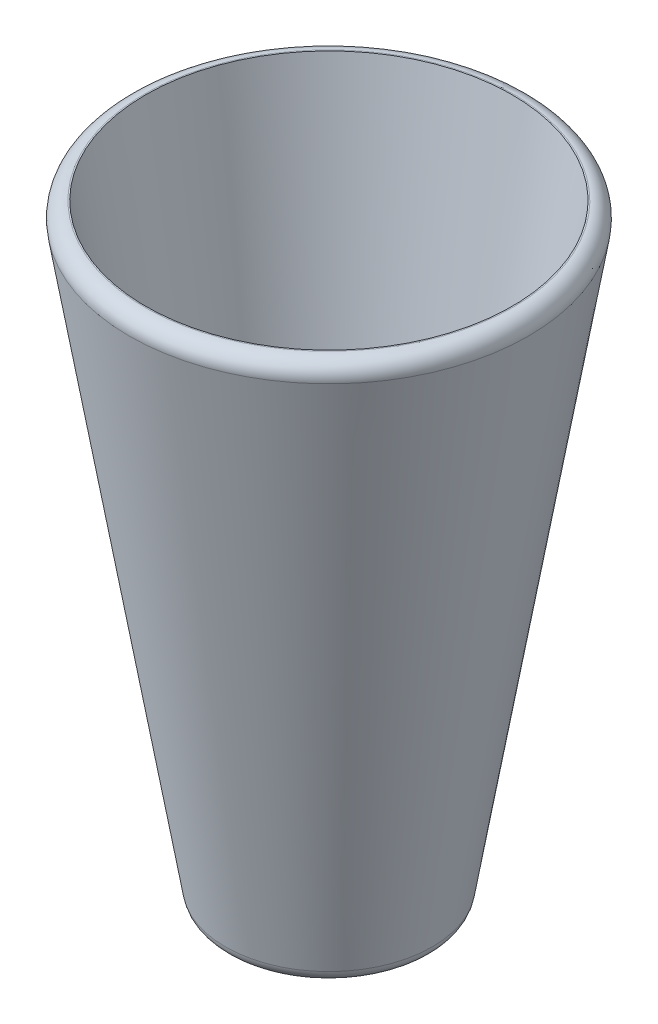
ISO-10303-21;
HEADER;
FILE_DESCRIPTION(('STEP AP214'),'2;1');
FILE_NAME('part.step','',(''),(''),'','','');
FILE_SCHEMA(('AUTOMOTIVE_DESIGN { 1 0 10303 214 1 1 1 1 }'));
ENDSEC;
DATA;
#1=APPLICATION_CONTEXT('core data for automotive mechanical design processes');
#2=APPLICATION_PROTOCOL_DEFINITION('international standard','automotive_design',2000,#1);
#3=PRODUCT_CONTEXT('',#1,'mechanical');
#4=PRODUCT('Part','Part','',(#3));
#5=PRODUCT_RELATED_PRODUCT_CATEGORY('part','',(#4));
#6=PRODUCT_DEFINITION_FORMATION('','',#4);
#7=PRODUCT_DEFINITION_CONTEXT('part definition',#1,'design');
#8=PRODUCT_DEFINITION('design','',#6,#7);
#9=PRODUCT_DEFINITION_SHAPE('','',#8);
#10=(LENGTH_UNIT() NAMED_UNIT(*) SI_UNIT(.MILLI.,.METRE.));
#11=(NAMED_UNIT(*) PLANE_ANGLE_UNIT() SI_UNIT($,.RADIAN.));
#12=(NAMED_UNIT(*) SI_UNIT($,.STERADIAN.) SOLID_ANGLE_UNIT());
#13=UNCERTAINTY_MEASURE_WITH_UNIT(LENGTH_MEASURE(1.E-05),#10,'distance_accuracy_value','');
#14=(GEOMETRIC_REPRESENTATION_CONTEXT(3) GLOBAL_UNCERTAINTY_ASSIGNED_CONTEXT((#13)) GLOBAL_UNIT_ASSIGNED_CONTEXT((#10,
#11,#12)) REPRESENTATION_CONTEXT('',''));
#15=CARTESIAN_POINT('',(0.,0.,0.));
#16=DIRECTION('',(0.,0.,1.));
#17=DIRECTION('',(1.,0.,0.));
#18=AXIS2_PLACEMENT_3D('',#15,#16,#17);
#19=CARTESIAN_POINT('',(1.46986121258818E-13,-380.841690925662,0.));
#20=DIRECTION('',(0.,1.,0.));
#21=DIRECTION('',(-1.,0.,0.));
#22=AXIS2_PLACEMENT_3D('',#19,#20,#21);
#23=PLANE('',#22);
#24=CARTESIAN_POINT('',(1.46986121258818E-13,-380.841690925662,0.));
#25=DIRECTION('',(0.,1.,0.));
#26=DIRECTION('',(-1.,0.,0.));
#27=AXIS2_PLACEMENT_3D('',#24,#25,#26);
#28=CIRCLE('',#27,174.586187348509);
#29=CARTESIAN_POINT('',(-174.586187348509,-380.841690925662,0.));
#30=VERTEX_POINT('',#29);
#31=EDGE_CURVE('E45',#30,#30,#28,.F.);
#32=ORIENTED_EDGE('',*,*,#31,.T.);
#33=EDGE_LOOP('',(#32));
#34=FACE_BOUND('',#33,.T.);
#35=ADVANCED_FACE('F37',(#34),#23,.F.);
#36=CARTESIAN_POINT('',(1.43319829761952E-13,-350.590646864208,0.));
#37=DIRECTION('',(0.,-1.,0.));
#38=DIRECTION('',(1.,0.,0.));
#39=AXIS2_PLACEMENT_3D('',#36,#37,#38);
#40=PLANE('',#39);
#41=CARTESIAN_POINT('',(1.43319829761952E-13,-350.590646864208,0.));
#42=DIRECTION('',(0.,1.,0.));
#43=DIRECTION('',(-1.,0.,0.));
#44=AXIS2_PLACEMENT_3D('',#41,#42,#43);
#45=CIRCLE('',#44,167.107446813264);
#46=CARTESIAN_POINT('',(-167.107446813263,-350.590646864208,0.));
#47=VERTEX_POINT('',#46);
#48=EDGE_CURVE('E61',#47,#47,#45,.T.);
#49=ORIENTED_EDGE('',*,*,#48,.T.);
#50=EDGE_LOOP('',(#49));
#51=FACE_BOUND('',#50,.T.);
#52=ADVANCED_FACE('F83',(#51),#40,.F.);
#53=CARTESIAN_POINT('',(0.,819.158309074338,0.));
#54=DIRECTION('',(0.,1.,0.));
#55=DIRECTION('',(-1.,0.,0.));
#56=AXIS2_PLACEMENT_3D('',#53,#54,#55);
#57=CONICAL_SURFACE('',#56,362.065606136355,0.165148677414627);
#58=ORIENTED_EDGE('',*,*,#48,.F.);
#59=EDGE_LOOP('',(#58));
#60=FACE_BOUND('',#59,.T.);
#61=CARTESIAN_POINT('',(0.,819.158309074338,0.));
#62=DIRECTION('',(0.,1.,0.));
#63=DIRECTION('',(-1.,0.,0.));
#64=AXIS2_PLACEMENT_3D('',#61,#62,#63);
#65=CIRCLE('',#64,362.065606136355);
#66=CARTESIAN_POINT('',(-362.065606136355,819.158309074338,0.));
#67=VERTEX_POINT('',#66);
#68=EDGE_CURVE('E65',#67,#67,#65,.T.);
#69=ORIENTED_EDGE('',*,*,#68,.T.);
#70=EDGE_LOOP('',(#69));
#71=FACE_BOUND('',#70,.T.);
#72=ADVANCED_FACE('F70',(#60,#71),#57,.F.);
#73=CARTESIAN_POINT('',(400.,819.158309074338,0.));
#74=DIRECTION('',(0.,-1.,0.));
#75=DIRECTION('',(1.,0.,0.));
#76=AXIS2_PLACEMENT_3D('',#73,#74,#75);
#77=PLANE('',#76);
#78=CARTESIAN_POINT('',(0.,819.158309074338,0.));
#79=DIRECTION('',(0.,-1.,0.));
#80=DIRECTION('',(1.,0.,0.));
#81=AXIS2_PLACEMENT_3D('',#78,#79,#80);
#82=CIRCLE('',#81,364.586187348509);
#83=CARTESIAN_POINT('',(364.586187348509,819.158309074338,0.));
#84=VERTEX_POINT('',#83);
#85=EDGE_CURVE('E10',#84,#84,#82,.F.);
#86=ORIENTED_EDGE('',*,*,#85,.T.);
#87=EDGE_LOOP('',(#86));
#88=FACE_BOUND('',#87,.T.);
#89=ORIENTED_EDGE('',*,*,#68,.F.);
#90=EDGE_LOOP('',(#89));
#91=FACE_BOUND('',#90,.T.);
#92=ADVANCED_FACE('F72',(#88,#91),#77,.F.);
#93=CARTESIAN_POINT('',(1.46986121258818E-13,-380.841690925662,0.));
#94=DIRECTION('',(0.,1.,0.));
#95=DIRECTION('',(-1.,0.,0.));
#96=AXIS2_PLACEMENT_3D('',#93,#94,#95);
#97=CONICAL_SURFACE('',#96,200.,0.165148677414627);
#98=CARTESIAN_POINT('',(1.43947987882603E-13,-355.773660544822,0.));
#99=DIRECTION('',(0.,-1.,0.));
#100=DIRECTION('',(1.,0.,0.));
#101=AXIS2_PLACEMENT_3D('',#98,#99,#100);
#102=CIRCLE('',#101,204.178005063473);
#103=CARTESIAN_POINT('',(204.178005063473,-355.773660544822,0.));
#104=VERTEX_POINT('',#103);
#105=EDGE_CURVE('E50',#104,#104,#102,.F.);
#106=ORIENTED_EDGE('',*,*,#105,.T.);
#107=EDGE_LOOP('',(#106));
#108=FACE_BOUND('',#107,.T.);
#109=CARTESIAN_POINT('',(0.,784.226339455178,0.));
#110=DIRECTION('',(0.,-1.,0.));
#111=DIRECTION('',(1.,0.,0.));
#112=AXIS2_PLACEMENT_3D('',#109,#110,#111);
#113=CIRCLE('',#112,394.178005063473);
#114=CARTESIAN_POINT('',(394.178005063473,784.226339455178,0.));
#115=VERTEX_POINT('',#114);
#116=EDGE_CURVE('E55',#115,#115,#113,.T.);
#117=ORIENTED_EDGE('',*,*,#116,.T.);
#118=EDGE_LOOP('',(#117));
#119=FACE_BOUND('',#118,.T.);
#120=ADVANCED_FACE('F74',(#108,#119),#97,.T.);
#121=CARTESIAN_POINT('',(1.43350255181517E-13,-350.841690925662,0.));
#122=DIRECTION('',(0.,1.,0.));
#123=DIRECTION('',(-1.,0.,0.));
#124=AXIS2_PLACEMENT_3D('',#121,#122,#123);
#125=TOROIDAL_SURFACE('',#124,174.586187348509,30.);
#126=ORIENTED_EDGE('',*,*,#31,.F.);
#127=EDGE_LOOP('',(#126));
#128=FACE_BOUND('',#127,.T.);
#129=ORIENTED_EDGE('',*,*,#105,.F.);
#130=EDGE_LOOP('',(#129));
#131=FACE_BOUND('',#130,.T.);
#132=ADVANCED_FACE('F80',(#128,#131),#125,.T.);
#133=CARTESIAN_POINT('',(0.,789.158309074338,0.));
#134=DIRECTION('',(0.,-1.,0.));
#135=DIRECTION('',(1.,0.,0.));
#136=AXIS2_PLACEMENT_3D('',#133,#134,#135);
#137=TOROIDAL_SURFACE('',#136,364.586187348509,30.);
#138=ORIENTED_EDGE('',*,*,#116,.F.);
#139=EDGE_LOOP('',(#138));
#140=FACE_BOUND('',#139,.T.);
#141=ORIENTED_EDGE('',*,*,#85,.F.);
#142=EDGE_LOOP('',(#141));
#143=FACE_BOUND('',#142,.T.);
#144=ADVANCED_FACE('F39',(#140,#143),#137,.T.);
#145=CLOSED_SHELL('',(#35,#52,#72,#92,#120,#132,#144));
#146=MANIFOLD_SOLID_BREP('B2',#145);
#147=ADVANCED_BREP_SHAPE_REPRESENTATION('',(#18,#146),#14);
#148=SHAPE_DEFINITION_REPRESENTATION(#9,#147);
ENDSEC;
END-ISO-10303-21;
